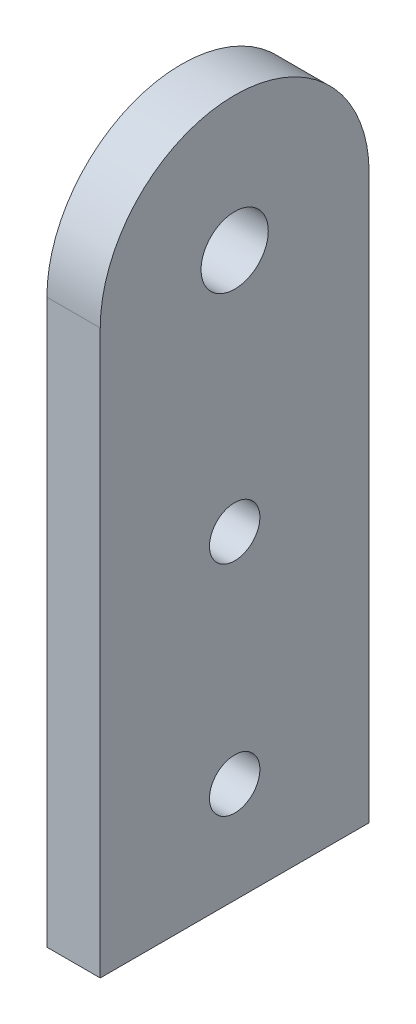
ISO-10303-21;
HEADER;
FILE_DESCRIPTION(('STEP AP214'),'2;1');
FILE_NAME('part.step','',(''),(''),'','','');
FILE_SCHEMA(('AUTOMOTIVE_DESIGN { 1 0 10303 214 1 1 1 1 }'));
ENDSEC;
DATA;
#1=APPLICATION_CONTEXT('core data for automotive mechanical design processes');
#2=APPLICATION_PROTOCOL_DEFINITION('international standard','automotive_design',2000,#1);
#3=PRODUCT_CONTEXT('',#1,'mechanical');
#4=PRODUCT('Part','Part','',(#3));
#5=PRODUCT_RELATED_PRODUCT_CATEGORY('part','',(#4));
#6=PRODUCT_DEFINITION_FORMATION('','',#4);
#7=PRODUCT_DEFINITION_CONTEXT('part definition',#1,'design');
#8=PRODUCT_DEFINITION('design','',#6,#7);
#9=PRODUCT_DEFINITION_SHAPE('','',#8);
#10=(LENGTH_UNIT() NAMED_UNIT(*) SI_UNIT(.MILLI.,.METRE.));
#11=(NAMED_UNIT(*) PLANE_ANGLE_UNIT() SI_UNIT($,.RADIAN.));
#12=(NAMED_UNIT(*) SI_UNIT($,.STERADIAN.) SOLID_ANGLE_UNIT());
#13=UNCERTAINTY_MEASURE_WITH_UNIT(LENGTH_MEASURE(1.E-05),#10,'distance_accuracy_value','');
#14=(GEOMETRIC_REPRESENTATION_CONTEXT(3) GLOBAL_UNCERTAINTY_ASSIGNED_CONTEXT((#13)) GLOBAL_UNIT_ASSIGNED_CONTEXT((#10,
#11,#12)) REPRESENTATION_CONTEXT('',''));
#15=CARTESIAN_POINT('',(0.,0.,0.));
#16=DIRECTION('',(0.,0.,1.));
#17=DIRECTION('',(1.,0.,0.));
#18=AXIS2_PLACEMENT_3D('',#15,#16,#17);
#19=CARTESIAN_POINT('',(3.175,0.,0.));
#20=DIRECTION('',(-1.,0.,0.));
#21=DIRECTION('',(0.,0.,1.));
#22=AXIS2_PLACEMENT_3D('',#19,#20,#21);
#23=PLANE('',#22);
#24=CARTESIAN_POINT('',(3.175,0.,0.));
#25=DIRECTION('',(1.,0.,0.));
#26=DIRECTION('',(0.,0.,1.));
#27=AXIS2_PLACEMENT_3D('',#24,#25,#26);
#28=CIRCLE('',#27,8.);
#29=CARTESIAN_POINT('',(3.175,0.,-8.));
#30=VERTEX_POINT('',#29);
#31=CARTESIAN_POINT('',(3.175,0.,8.));
#32=VERTEX_POINT('',#31);
#33=EDGE_CURVE('E86',#30,#32,#28,.T.);
#34=ORIENTED_EDGE('',*,*,#33,.T.);
#35=DIRECTION('',(0.,-1.,0.));
#36=VECTOR('',#35,1.);
#37=CARTESIAN_POINT('',(3.175,0.,8.));
#38=LINE('',#37,#36);
#39=CARTESIAN_POINT('',(3.175,-33.5,8.));
#40=VERTEX_POINT('',#39);
#41=EDGE_CURVE('E81',#32,#40,#38,.T.);
#42=ORIENTED_EDGE('',*,*,#41,.T.);
#43=DIRECTION('',(0.,0.,-1.));
#44=VECTOR('',#43,1.);
#45=CARTESIAN_POINT('',(3.175,-33.5,8.));
#46=LINE('',#45,#44);
#47=CARTESIAN_POINT('',(3.175,-33.5,-8.));
#48=VERTEX_POINT('',#47);
#49=EDGE_CURVE('E84',#40,#48,#46,.T.);
#50=ORIENTED_EDGE('',*,*,#49,.T.);
#51=DIRECTION('',(0.,1.,0.));
#52=VECTOR('',#51,1.);
#53=CARTESIAN_POINT('',(3.175,-33.5,-8.));
#54=LINE('',#53,#52);
#55=EDGE_CURVE('E51',#48,#30,#54,.T.);
#56=ORIENTED_EDGE('',*,*,#55,.T.);
#57=EDGE_LOOP('',(#34,#42,#50,#56));
#58=FACE_BOUND('',#57,.T.);
#59=CARTESIAN_POINT('',(3.175,0.,0.));
#60=DIRECTION('',(1.,0.,0.));
#61=DIRECTION('',(0.,0.,-1.));
#62=AXIS2_PLACEMENT_3D('',#59,#60,#61);
#63=CIRCLE('',#62,2.);
#64=CARTESIAN_POINT('',(3.175,0.,-2.));
#65=VERTEX_POINT('',#64);
#66=EDGE_CURVE('E101',#65,#65,#63,.T.);
#67=ORIENTED_EDGE('',*,*,#66,.F.);
#68=EDGE_LOOP('',(#67));
#69=FACE_BOUND('',#68,.T.);
#70=CARTESIAN_POINT('',(3.175,-14.5,0.));
#71=DIRECTION('',(1.,0.,0.));
#72=DIRECTION('',(0.,0.,-1.));
#73=AXIS2_PLACEMENT_3D('',#70,#71,#72);
#74=CIRCLE('',#73,1.5);
#75=CARTESIAN_POINT('',(3.175,-14.5,-1.5));
#76=VERTEX_POINT('',#75);
#77=EDGE_CURVE('E116',#76,#76,#74,.T.);
#78=ORIENTED_EDGE('',*,*,#77,.F.);
#79=EDGE_LOOP('',(#78));
#80=FACE_BOUND('',#79,.T.);
#81=CARTESIAN_POINT('',(3.175,-27.5,0.));
#82=DIRECTION('',(1.,0.,0.));
#83=DIRECTION('',(0.,0.,-1.));
#84=AXIS2_PLACEMENT_3D('',#81,#82,#83);
#85=CIRCLE('',#84,1.5);
#86=CARTESIAN_POINT('',(3.175,-27.5,-1.5));
#87=VERTEX_POINT('',#86);
#88=EDGE_CURVE('E122',#87,#87,#85,.T.);
#89=ORIENTED_EDGE('',*,*,#88,.F.);
#90=EDGE_LOOP('',(#89));
#91=FACE_BOUND('',#90,.T.);
#92=ADVANCED_FACE('F34',(#58,#69,#80,#91),#23,.F.);
#93=CARTESIAN_POINT('',(0.,0.,0.));
#94=DIRECTION('',(-1.,0.,0.));
#95=DIRECTION('',(0.,0.,1.));
#96=AXIS2_PLACEMENT_3D('',#93,#94,#95);
#97=PLANE('',#96);
#98=CARTESIAN_POINT('',(0.,-14.5,0.));
#99=DIRECTION('',(1.,0.,0.));
#100=DIRECTION('',(0.,0.,-1.));
#101=AXIS2_PLACEMENT_3D('',#98,#99,#100);
#102=CIRCLE('',#101,1.5);
#103=CARTESIAN_POINT('',(0.,-14.5,-1.5));
#104=VERTEX_POINT('',#103);
#105=EDGE_CURVE('E119',#104,#104,#102,.T.);
#106=ORIENTED_EDGE('',*,*,#105,.T.);
#107=EDGE_LOOP('',(#106));
#108=FACE_BOUND('',#107,.T.);
#109=CARTESIAN_POINT('',(0.,0.,0.));
#110=DIRECTION('',(1.,0.,0.));
#111=DIRECTION('',(0.,0.,1.));
#112=AXIS2_PLACEMENT_3D('',#109,#110,#111);
#113=CIRCLE('',#112,8.);
#114=CARTESIAN_POINT('',(0.,0.,-8.));
#115=VERTEX_POINT('',#114);
#116=CARTESIAN_POINT('',(0.,0.,8.));
#117=VERTEX_POINT('',#116);
#118=EDGE_CURVE('E98',#115,#117,#113,.T.);
#119=ORIENTED_EDGE('',*,*,#118,.F.);
#120=DIRECTION('',(0.,1.,0.));
#121=VECTOR('',#120,1.);
#122=CARTESIAN_POINT('',(0.,-33.5,-8.));
#123=LINE('',#122,#121);
#124=CARTESIAN_POINT('',(0.,-33.5,-8.));
#125=VERTEX_POINT('',#124);
#126=EDGE_CURVE('E74',#125,#115,#123,.T.);
#127=ORIENTED_EDGE('',*,*,#126,.F.);
#128=DIRECTION('',(0.,0.,-1.));
#129=VECTOR('',#128,1.);
#130=CARTESIAN_POINT('',(0.,-33.5,8.));
#131=LINE('',#130,#129);
#132=CARTESIAN_POINT('',(0.,-33.5,8.));
#133=VERTEX_POINT('',#132);
#134=EDGE_CURVE('E68',#133,#125,#131,.T.);
#135=ORIENTED_EDGE('',*,*,#134,.F.);
#136=DIRECTION('',(0.,-1.,0.));
#137=VECTOR('',#136,1.);
#138=CARTESIAN_POINT('',(0.,0.,8.));
#139=LINE('',#138,#137);
#140=EDGE_CURVE('E90',#117,#133,#139,.T.);
#141=ORIENTED_EDGE('',*,*,#140,.F.);
#142=EDGE_LOOP('',(#119,#127,#135,#141));
#143=FACE_BOUND('',#142,.T.);
#144=CARTESIAN_POINT('',(0.,0.,0.));
#145=DIRECTION('',(1.,0.,0.));
#146=DIRECTION('',(0.,0.,-1.));
#147=AXIS2_PLACEMENT_3D('',#144,#145,#146);
#148=CIRCLE('',#147,2.);
#149=CARTESIAN_POINT('',(0.,0.,-2.));
#150=VERTEX_POINT('',#149);
#151=EDGE_CURVE('E113',#150,#150,#148,.T.);
#152=ORIENTED_EDGE('',*,*,#151,.T.);
#153=EDGE_LOOP('',(#152));
#154=FACE_BOUND('',#153,.T.);
#155=CARTESIAN_POINT('',(0.,-27.5,0.));
#156=DIRECTION('',(1.,0.,0.));
#157=DIRECTION('',(0.,0.,-1.));
#158=AXIS2_PLACEMENT_3D('',#155,#156,#157);
#159=CIRCLE('',#158,1.5);
#160=CARTESIAN_POINT('',(0.,-27.5,-1.5));
#161=VERTEX_POINT('',#160);
#162=EDGE_CURVE('E125',#161,#161,#159,.T.);
#163=ORIENTED_EDGE('',*,*,#162,.T.);
#164=EDGE_LOOP('',(#163));
#165=FACE_BOUND('',#164,.T.);
#166=ADVANCED_FACE('F109',(#108,#143,#154,#165),#97,.T.);
#167=CARTESIAN_POINT('',(3.175,0.,0.));
#168=DIRECTION('',(-1.,0.,0.));
#169=DIRECTION('',(0.,0.,1.));
#170=AXIS2_PLACEMENT_3D('',#167,#168,#169);
#171=CYLINDRICAL_SURFACE('',#170,8.);
#172=ORIENTED_EDGE('',*,*,#118,.T.);
#173=DIRECTION('',(-1.,0.,0.));
#174=VECTOR('',#173,1.);
#175=CARTESIAN_POINT('',(3.175,0.,8.));
#176=LINE('',#175,#174);
#177=EDGE_CURVE('E11',#32,#117,#176,.T.);
#178=ORIENTED_EDGE('',*,*,#177,.F.);
#179=ORIENTED_EDGE('',*,*,#33,.F.);
#180=DIRECTION('',(-1.,0.,0.));
#181=VECTOR('',#180,1.);
#182=CARTESIAN_POINT('',(3.175,0.,-8.));
#183=LINE('',#182,#181);
#184=EDGE_CURVE('E94',#30,#115,#183,.T.);
#185=ORIENTED_EDGE('',*,*,#184,.T.);
#186=EDGE_LOOP('',(#172,#178,#179,#185));
#187=FACE_BOUND('',#186,.T.);
#188=ADVANCED_FACE('F36',(#187),#171,.T.);
#189=CARTESIAN_POINT('',(3.175,0.,8.));
#190=DIRECTION('',(0.,0.,-1.));
#191=DIRECTION('',(0.,1.,0.));
#192=AXIS2_PLACEMENT_3D('',#189,#190,#191);
#193=PLANE('',#192);
#194=ORIENTED_EDGE('',*,*,#140,.T.);
#195=DIRECTION('',(-1.,0.,0.));
#196=VECTOR('',#195,1.);
#197=CARTESIAN_POINT('',(3.175,-33.5,8.));
#198=LINE('',#197,#196);
#199=EDGE_CURVE('E43',#40,#133,#198,.T.);
#200=ORIENTED_EDGE('',*,*,#199,.F.);
#201=ORIENTED_EDGE('',*,*,#41,.F.);
#202=ORIENTED_EDGE('',*,*,#177,.T.);
#203=EDGE_LOOP('',(#194,#200,#201,#202));
#204=FACE_BOUND('',#203,.T.);
#205=ADVANCED_FACE('F89',(#204),#193,.F.);
#206=CARTESIAN_POINT('',(3.175,-33.5,8.));
#207=DIRECTION('',(0.,1.,0.));
#208=DIRECTION('',(0.,0.,1.));
#209=AXIS2_PLACEMENT_3D('',#206,#207,#208);
#210=PLANE('',#209);
#211=ORIENTED_EDGE('',*,*,#134,.T.);
#212=DIRECTION('',(-1.,0.,0.));
#213=VECTOR('',#212,1.);
#214=CARTESIAN_POINT('',(3.175,-33.5,-8.));
#215=LINE('',#214,#213);
#216=EDGE_CURVE('E91',#48,#125,#215,.T.);
#217=ORIENTED_EDGE('',*,*,#216,.F.);
#218=ORIENTED_EDGE('',*,*,#49,.F.);
#219=ORIENTED_EDGE('',*,*,#199,.T.);
#220=EDGE_LOOP('',(#211,#217,#218,#219));
#221=FACE_BOUND('',#220,.T.);
#222=ADVANCED_FACE('F92',(#221),#210,.F.);
#223=CARTESIAN_POINT('',(3.175,-33.5,-8.));
#224=DIRECTION('',(0.,0.,1.));
#225=DIRECTION('',(0.,-1.,0.));
#226=AXIS2_PLACEMENT_3D('',#223,#224,#225);
#227=PLANE('',#226);
#228=ORIENTED_EDGE('',*,*,#126,.T.);
#229=ORIENTED_EDGE('',*,*,#184,.F.);
#230=ORIENTED_EDGE('',*,*,#55,.F.);
#231=ORIENTED_EDGE('',*,*,#216,.T.);
#232=EDGE_LOOP('',(#228,#229,#230,#231));
#233=FACE_BOUND('',#232,.T.);
#234=ADVANCED_FACE('F106',(#233),#227,.F.);
#235=CARTESIAN_POINT('',(3.175,0.,0.));
#236=DIRECTION('',(-1.,0.,0.));
#237=DIRECTION('',(0.,0.,1.));
#238=AXIS2_PLACEMENT_3D('',#235,#236,#237);
#239=CYLINDRICAL_SURFACE('',#238,2.);
#240=ORIENTED_EDGE('',*,*,#66,.T.);
#241=EDGE_LOOP('',(#240));
#242=FACE_BOUND('',#241,.T.);
#243=ORIENTED_EDGE('',*,*,#151,.F.);
#244=EDGE_LOOP('',(#243));
#245=FACE_BOUND('',#244,.T.);
#246=ADVANCED_FACE('F142',(#242,#245),#239,.F.);
#247=CARTESIAN_POINT('',(3.175,-14.5,0.));
#248=DIRECTION('',(-1.,0.,0.));
#249=DIRECTION('',(0.,0.,1.));
#250=AXIS2_PLACEMENT_3D('',#247,#248,#249);
#251=CYLINDRICAL_SURFACE('',#250,1.5);
#252=ORIENTED_EDGE('',*,*,#77,.T.);
#253=EDGE_LOOP('',(#252));
#254=FACE_BOUND('',#253,.T.);
#255=ORIENTED_EDGE('',*,*,#105,.F.);
#256=EDGE_LOOP('',(#255));
#257=FACE_BOUND('',#256,.T.);
#258=ADVANCED_FACE('F188',(#254,#257),#251,.F.);
#259=CARTESIAN_POINT('',(3.175,-27.5,0.));
#260=DIRECTION('',(-1.,0.,0.));
#261=DIRECTION('',(0.,0.,1.));
#262=AXIS2_PLACEMENT_3D('',#259,#260,#261);
#263=CYLINDRICAL_SURFACE('',#262,1.5);
#264=ORIENTED_EDGE('',*,*,#88,.T.);
#265=EDGE_LOOP('',(#264));
#266=FACE_BOUND('',#265,.T.);
#267=ORIENTED_EDGE('',*,*,#162,.F.);
#268=EDGE_LOOP('',(#267));
#269=FACE_BOUND('',#268,.T.);
#270=ADVANCED_FACE('F131',(#266,#269),#263,.F.);
#271=CLOSED_SHELL('',(#92,#166,#188,#205,#222,#234,#246,#258,#270));
#272=MANIFOLD_SOLID_BREP('B2',#271);
#273=ADVANCED_BREP_SHAPE_REPRESENTATION('',(#18,#272),#14);
#274=SHAPE_DEFINITION_REPRESENTATION(#9,#273);
ENDSEC;
END-ISO-10303-21;
